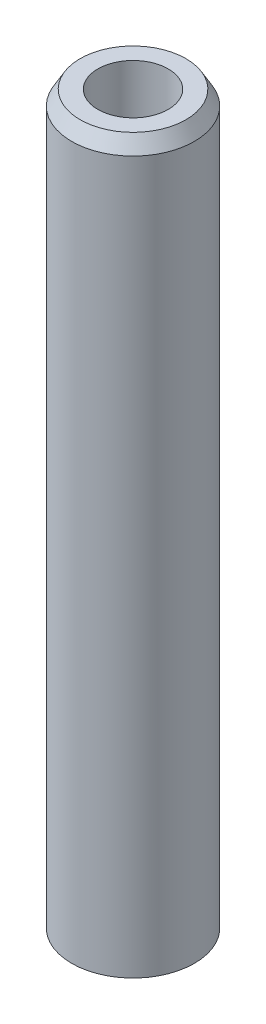
ISO-10303-21;
HEADER;
FILE_DESCRIPTION(('STEP AP214'),'2;1');
FILE_NAME('part.step','',(''),(''),'','','');
FILE_SCHEMA(('AUTOMOTIVE_DESIGN { 1 0 10303 214 1 1 1 1 }'));
ENDSEC;
DATA;
#1=APPLICATION_CONTEXT('core data for automotive mechanical design processes');
#2=APPLICATION_PROTOCOL_DEFINITION('international standard','automotive_design',2000,#1);
#3=PRODUCT_CONTEXT('',#1,'mechanical');
#4=PRODUCT('Part','Part','',(#3));
#5=PRODUCT_RELATED_PRODUCT_CATEGORY('part','',(#4));
#6=PRODUCT_DEFINITION_FORMATION('','',#4);
#7=PRODUCT_DEFINITION_CONTEXT('part definition',#1,'design');
#8=PRODUCT_DEFINITION('design','',#6,#7);
#9=PRODUCT_DEFINITION_SHAPE('','',#8);
#10=(LENGTH_UNIT() NAMED_UNIT(*) SI_UNIT(.MILLI.,.METRE.));
#11=(NAMED_UNIT(*) PLANE_ANGLE_UNIT() SI_UNIT($,.RADIAN.));
#12=(NAMED_UNIT(*) SI_UNIT($,.STERADIAN.) SOLID_ANGLE_UNIT());
#13=UNCERTAINTY_MEASURE_WITH_UNIT(LENGTH_MEASURE(1.E-05),#10,'distance_accuracy_value','');
#14=(GEOMETRIC_REPRESENTATION_CONTEXT(3) GLOBAL_UNCERTAINTY_ASSIGNED_CONTEXT((#13)) GLOBAL_UNIT_ASSIGNED_CONTEXT((#10,
#11,#12)) REPRESENTATION_CONTEXT('',''));
#15=CARTESIAN_POINT('',(0.,0.,0.));
#16=DIRECTION('',(0.,0.,1.));
#17=DIRECTION('',(1.,0.,0.));
#18=AXIS2_PLACEMENT_3D('',#15,#16,#17);
#19=CARTESIAN_POINT('',(0.,89.838116210811,0.));
#20=DIRECTION('',(0.,-1.,0.));
#21=DIRECTION('',(0.,0.,-1.));
#22=AXIS2_PLACEMENT_3D('',#19,#20,#21);
#23=CYLINDRICAL_SURFACE('',#22,7.5);
#24=CARTESIAN_POINT('',(0.,88.0537006644603,0.));
#25=DIRECTION('',(0.,1.,0.));
#26=DIRECTION('',(0.,0.,1.));
#27=AXIS2_PLACEMENT_3D('',#24,#25,#26);
#28=CIRCLE('',#27,7.5);
#29=CARTESIAN_POINT('',(0.,88.0537006644603,-7.5));
#30=VERTEX_POINT('',#29);
#31=EDGE_CURVE('E50',#30,#30,#28,.F.);
#32=ORIENTED_EDGE('',*,*,#31,.T.);
#33=EDGE_LOOP('',(#32));
#34=FACE_BOUND('',#33,.T.);
#35=CARTESIAN_POINT('',(0.,1.03023279603172,0.));
#36=DIRECTION('',(0.,1.,0.));
#37=DIRECTION('',(0.,0.,1.));
#38=AXIS2_PLACEMENT_3D('',#35,#36,#37);
#39=CIRCLE('',#38,7.5);
#40=CARTESIAN_POINT('',(0.,1.03023279603172,7.5));
#41=VERTEX_POINT('',#40);
#42=EDGE_CURVE('E51',#41,#41,#39,.T.);
#43=ORIENTED_EDGE('',*,*,#42,.T.);
#44=EDGE_LOOP('',(#43));
#45=FACE_BOUND('',#44,.T.);
#46=ADVANCED_FACE('F39',(#34,#45),#23,.T.);
#47=CARTESIAN_POINT('',(0.,89.838116210811,0.));
#48=DIRECTION('',(0.,1.,0.));
#49=DIRECTION('',(0.,0.,1.));
#50=AXIS2_PLACEMENT_3D('',#47,#48,#49);
#51=PLANE('',#50);
#52=CARTESIAN_POINT('',(0.,89.838116210811,0.));
#53=DIRECTION('',(0.,1.,0.));
#54=DIRECTION('',(0.,0.,1.));
#55=AXIS2_PLACEMENT_3D('',#52,#53,#54);
#56=CIRCLE('',#55,6.4697672039683);
#57=CARTESIAN_POINT('',(0.,89.838116210811,-6.46976720396831));
#58=VERTEX_POINT('',#57);
#59=EDGE_CURVE('E54',#58,#58,#56,.T.);
#60=ORIENTED_EDGE('',*,*,#59,.T.);
#61=EDGE_LOOP('',(#60));
#62=FACE_BOUND('',#61,.T.);
#63=CARTESIAN_POINT('',(0.,89.838116210811,0.));
#64=DIRECTION('',(0.,1.,0.));
#65=DIRECTION('',(0.,0.,1.));
#66=AXIS2_PLACEMENT_3D('',#63,#64,#65);
#67=CIRCLE('',#66,4.29899313397693);
#68=CARTESIAN_POINT('',(0.,89.838116210811,4.29899313397693));
#69=VERTEX_POINT('',#68);
#70=EDGE_CURVE('E58',#69,#69,#67,.T.);
#71=ORIENTED_EDGE('',*,*,#70,.F.);
#72=EDGE_LOOP('',(#71));
#73=FACE_BOUND('',#72,.T.);
#74=ADVANCED_FACE('F69',(#62,#73),#51,.T.);
#75=CARTESIAN_POINT('',(0.,0.,0.));
#76=DIRECTION('',(0.,1.,0.));
#77=DIRECTION('',(0.,0.,1.));
#78=AXIS2_PLACEMENT_3D('',#75,#76,#77);
#79=PLANE('',#78);
#80=CARTESIAN_POINT('',(0.,0.,0.));
#81=DIRECTION('',(0.,1.,0.));
#82=DIRECTION('',(0.,0.,1.));
#83=AXIS2_PLACEMENT_3D('',#80,#81,#82);
#84=CIRCLE('',#83,5.71558445364931);
#85=CARTESIAN_POINT('',(0.,0.,5.71558445364931));
#86=VERTEX_POINT('',#85);
#87=EDGE_CURVE('E10',#86,#86,#84,.F.);
#88=ORIENTED_EDGE('',*,*,#87,.T.);
#89=EDGE_LOOP('',(#88));
#90=FACE_BOUND('',#89,.T.);
#91=CARTESIAN_POINT('',(0.,0.,0.));
#92=DIRECTION('',(0.,1.,0.));
#93=DIRECTION('',(0.,0.,1.));
#94=AXIS2_PLACEMENT_3D('',#91,#92,#93);
#95=CIRCLE('',#94,4.29899313397693);
#96=CARTESIAN_POINT('',(0.,0.,4.29899313397693));
#97=VERTEX_POINT('',#96);
#98=EDGE_CURVE('E63',#97,#97,#95,.T.);
#99=ORIENTED_EDGE('',*,*,#98,.T.);
#100=EDGE_LOOP('',(#99));
#101=FACE_BOUND('',#100,.T.);
#102=ADVANCED_FACE('F75',(#90,#101),#79,.F.);
#103=CARTESIAN_POINT('',(0.,89.838116210811,0.));
#104=DIRECTION('',(0.,-1.,0.));
#105=DIRECTION('',(0.,0.,-1.));
#106=AXIS2_PLACEMENT_3D('',#103,#104,#105);
#107=CYLINDRICAL_SURFACE('',#106,4.29899313397693);
#108=ORIENTED_EDGE('',*,*,#70,.T.);
#109=EDGE_LOOP('',(#108));
#110=FACE_BOUND('',#109,.T.);
#111=ORIENTED_EDGE('',*,*,#98,.F.);
#112=EDGE_LOOP('',(#111));
#113=FACE_BOUND('',#112,.T.);
#114=ADVANCED_FACE('F70',(#110,#113),#107,.F.);
#115=CARTESIAN_POINT('',(0.,89.838116210811,0.));
#116=DIRECTION('',(0.,-1.,0.));
#117=DIRECTION('',(0.,0.,-1.));
#118=AXIS2_PLACEMENT_3D('',#115,#116,#117);
#119=CONICAL_SURFACE('',#118,6.4697672039683,0.523598775598293);
#120=CARTESIAN_POINT('',(0.,88.0537006644603,-7.5));
#121=CARTESIAN_POINT('',(0.,88.0722883264015,-7.48926840837467));
#122=CARTESIAN_POINT('',(0.,88.0908759883426,-7.47853681674934));
#123=CARTESIAN_POINT('',(0.,88.1280513122249,-7.45707363349868));
#124=CARTESIAN_POINT('',(0.,88.1466389741661,-7.44634204187335));
#125=CARTESIAN_POINT('',(0.,88.1838142980484,-7.42487885862269));
#126=CARTESIAN_POINT('',(0.,88.2024019599895,-7.41414726699736));
#127=CARTESIAN_POINT('',(0.,88.2395772838718,-7.3926840837467));
#128=CARTESIAN_POINT('',(0.,88.258164945813,-7.38195249212137));
#129=CARTESIAN_POINT('',(0.,88.2953402696953,-7.36048930887071));
#130=CARTESIAN_POINT('',(0.,88.3139279316364,-7.34975771724538));
#131=CARTESIAN_POINT('',(0.,88.3511032555188,-7.32829453399472));
#132=CARTESIAN_POINT('',(0.,88.3696909174599,-7.31756294236939));
#133=CARTESIAN_POINT('',(0.,88.4068662413422,-7.29609975911873));
#134=CARTESIAN_POINT('',(0.,88.4254539032834,-7.2853681674934));
#135=CARTESIAN_POINT('',(0.,88.4626292271657,-7.26390498424274));
#136=CARTESIAN_POINT('',(0.,88.4812168891068,-7.25317339261741));
#137=CARTESIAN_POINT('',(0.,88.5183922129891,-7.23171020936675));
#138=CARTESIAN_POINT('',(0.,88.5369798749303,-7.22097861774142));
#139=CARTESIAN_POINT('',(0.,88.5741551988126,-7.19951543449076));
#140=CARTESIAN_POINT('',(0.,88.5927428607537,-7.18878384286543));
#141=CARTESIAN_POINT('',(0.,88.6299181846361,-7.16732065961477));
#142=CARTESIAN_POINT('',(0.,88.6485058465772,-7.15658906798944));
#143=CARTESIAN_POINT('',(0.,88.6856811704595,-7.13512588473878));
#144=CARTESIAN_POINT('',(0.,88.7042688324007,-7.12439429311345));
#145=CARTESIAN_POINT('',(0.,88.741444156283,-7.10293110986279));
#146=CARTESIAN_POINT('',(0.,88.7600318182241,-7.09219951823746));
#147=CARTESIAN_POINT('',(0.,88.7972071421064,-7.0707363349868));
#148=CARTESIAN_POINT('',(0.,88.8157948040476,-7.06000474336147));
#149=CARTESIAN_POINT('',(0.,88.8529701279299,-7.03854156011081));
#150=CARTESIAN_POINT('',(0.,88.871557789871,-7.02780996848547));
#151=CARTESIAN_POINT('',(0.,88.9087331137533,-7.00634678523481));
#152=CARTESIAN_POINT('',(0.,88.9273207756945,-6.99561519360949));
#153=CARTESIAN_POINT('',(0.,88.9644960995768,-6.97415201035883));
#154=CARTESIAN_POINT('',(0.,88.9830837615179,-6.96342041873349));
#155=CARTESIAN_POINT('',(0.,89.0202590854003,-6.94195723548283));
#156=CARTESIAN_POINT('',(0.,89.0388467473414,-6.9312256438575));
#157=CARTESIAN_POINT('',(0.,89.0760220712237,-6.90976246060684));
#158=CARTESIAN_POINT('',(0.,89.0946097331649,-6.89903086898151));
#159=CARTESIAN_POINT('',(0.,89.1317850570472,-6.87756768573085));
#160=CARTESIAN_POINT('',(0.,89.1503727189883,-6.86683609410552));
#161=CARTESIAN_POINT('',(0.,89.1875480428706,-6.84537291085486));
#162=CARTESIAN_POINT('',(0.,89.2061357048118,-6.83464131922953));
#163=CARTESIAN_POINT('',(0.,89.2433110286941,-6.81317813597887));
#164=CARTESIAN_POINT('',(0.,89.2618986906352,-6.80244654435354));
#165=CARTESIAN_POINT('',(0.,89.2990740145176,-6.78098336110288));
#166=CARTESIAN_POINT('',(0.,89.3176616764587,-6.77025176947755));
#167=CARTESIAN_POINT('',(0.,89.354837000341,-6.74878858622689));
#168=CARTESIAN_POINT('',(0.,89.3734246622822,-6.73805699460156));
#169=CARTESIAN_POINT('',(0.,89.4105999861645,-6.7165938113509));
#170=CARTESIAN_POINT('',(0.,89.4291876481056,-6.70586221972557));
#171=CARTESIAN_POINT('',(0.,89.4663629719879,-6.68439903647491));
#172=CARTESIAN_POINT('',(0.,89.4849506339291,-6.67366744484958));
#173=CARTESIAN_POINT('',(0.,89.5221259578114,-6.65220426159892));
#174=CARTESIAN_POINT('',(0.,89.5407136197525,-6.64147266997359));
#175=CARTESIAN_POINT('',(0.,89.5778889436348,-6.62000948672293));
#176=CARTESIAN_POINT('',(0.,89.596476605576,-6.6092778950976));
#177=CARTESIAN_POINT('',(0.,89.6336519294583,-6.58781471184694));
#178=CARTESIAN_POINT('',(0.,89.6522395913995,-6.57708312022161));
#179=CARTESIAN_POINT('',(0.,89.6894149152818,-6.55561993697095));
#180=CARTESIAN_POINT('',(0.,89.7080025772229,-6.54488834534562));
#181=CARTESIAN_POINT('',(0.,89.7451779011052,-6.52342516209496));
#182=CARTESIAN_POINT('',(0.,89.7637655630464,-6.51269357046963));
#183=CARTESIAN_POINT('',(0.,89.8009408869287,-6.49123038721896));
#184=CARTESIAN_POINT('',(0.,89.8195285488698,-6.48049879559363));
#185=CARTESIAN_POINT('',(0.,89.838116210811,-6.46976720396831));
#186=B_SPLINE_CURVE_WITH_KNOTS('',3,(#120,#121,#122,#123,#124,#125,#126,#127,#128,#129,#130,
#131,#132,#133,#134,#135,#136,#137,#138,#139,#140,#141,#142,#143,#144,#145,#146,#147,#148,#149,
#150,#151,#152,#153,#154,#155,#156,#157,#158,#159,#160,#161,#162,#163,#164,#165,#166,#167,#168,
#169,#170,#171,#172,#173,#174,#175,#176,#177,#178,#179,#180,#181,#182,#183,#184,#185),
.UNSPECIFIED.,.F.,.F.,(4,2,2,2,2,2,2,2,2,2,2,2,2,2,2,2,2,2,2,2,2,2,2,2,2,2,2,2,2,2,2,2,4),(0.,
0.0643895497519755,0.128779099503963,0.193168649255939,0.257558199007927,0.321947748759903,
0.386337298511891,0.450726848263867,0.515116398015854,0.57950594776783,0.643895497519818,
0.708285047271794,0.772674597023781,0.837064146775757,0.901453696527745,0.965843246279721,
1.03023279603171,1.09462234578368,1.15901189553567,1.22340144528765,1.28779099503964,
1.35218054479161,1.4165700945436,1.48095964429558,1.54534919404756,1.60973874379954,
1.67412829355153,1.7385178433035,1.80290739305549,1.86729694280747,1.93168649255945,
1.99607604231143,2.06046559206342),.UNSPECIFIED.);
#187=EDGE_CURVE('BSEAM81',#30,#58,#186,.T.);
#188=ORIENTED_EDGE('',*,*,#31,.F.);
#189=ORIENTED_EDGE('',*,*,#59,.F.);
#190=ORIENTED_EDGE('',*,*,#187,.T.);
#191=ORIENTED_EDGE('',*,*,#187,.F.);
#192=EDGE_LOOP('',(#188,#190,#189,#191));
#193=FACE_BOUND('',#192,.T.);
#194=ADVANCED_FACE('F81',(#193),#119,.T.);
#195=CARTESIAN_POINT('',(0.,1.03023279603172,0.));
#196=DIRECTION('',(0.,1.,0.));
#197=DIRECTION('',(0.,0.,1.));
#198=AXIS2_PLACEMENT_3D('',#195,#196,#197);
#199=CONICAL_SURFACE('',#198,7.5,1.0471975511966);
#200=ORIENTED_EDGE('',*,*,#87,.F.);
#201=EDGE_LOOP('',(#200));
#202=FACE_BOUND('',#201,.T.);
#203=ORIENTED_EDGE('',*,*,#42,.F.);
#204=EDGE_LOOP('',(#203));
#205=FACE_BOUND('',#204,.T.);
#206=ADVANCED_FACE('F45',(#202,#205),#199,.T.);
#207=CLOSED_SHELL('',(#46,#74,#102,#114,#194,#206));
#208=MANIFOLD_SOLID_BREP('B2',#207);
#209=ADVANCED_BREP_SHAPE_REPRESENTATION('',(#18,#208),#14);
#210=SHAPE_DEFINITION_REPRESENTATION(#9,#209);
ENDSEC;
END-ISO-10303-21;
